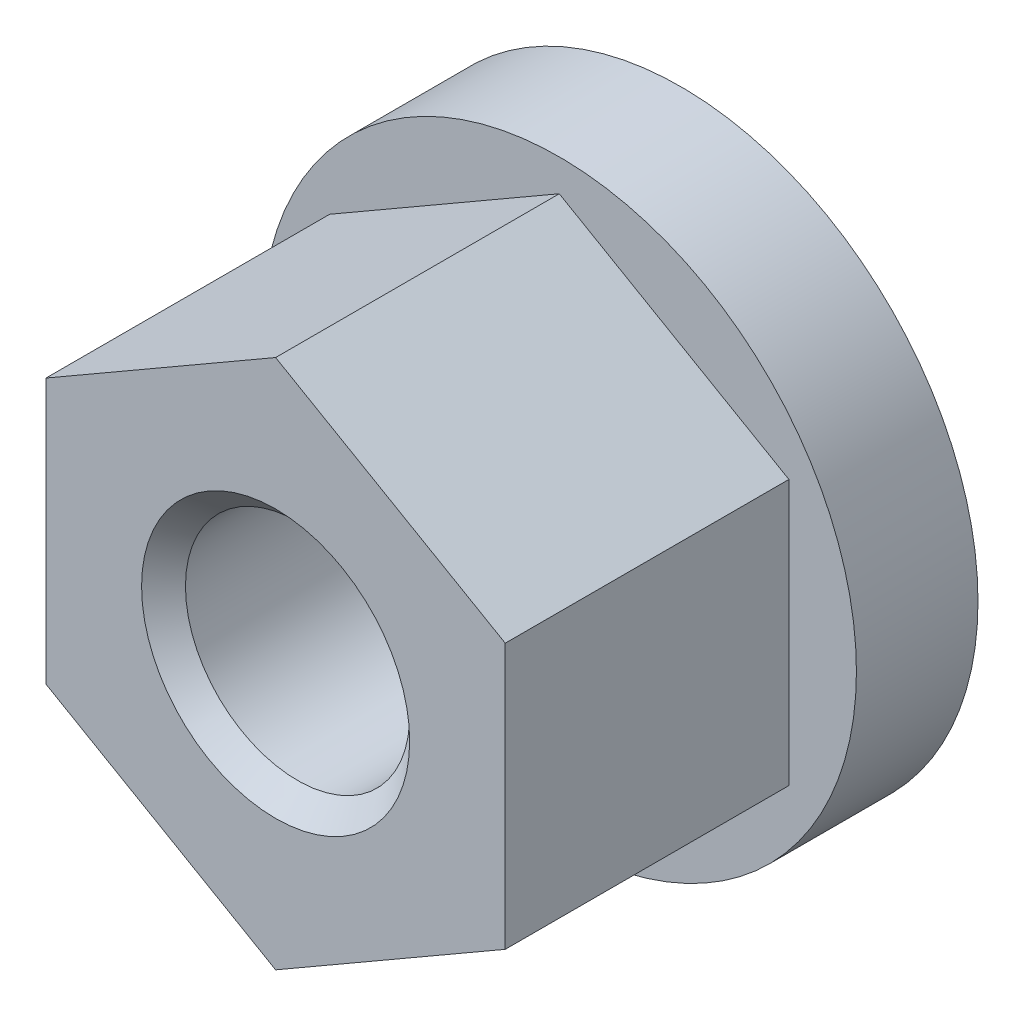
ISO-10303-21;
HEADER;
FILE_DESCRIPTION(('STEP AP214'),'2;1');
FILE_NAME('part.step','',(''),(''),'','','');
FILE_SCHEMA(('AUTOMOTIVE_DESIGN { 1 0 10303 214 1 1 1 1 }'));
ENDSEC;
DATA;
#1=APPLICATION_CONTEXT('core data for automotive mechanical design processes');
#2=APPLICATION_PROTOCOL_DEFINITION('international standard','automotive_design',2000,#1);
#3=PRODUCT_CONTEXT('',#1,'mechanical');
#4=PRODUCT('Part','Part','',(#3));
#5=PRODUCT_RELATED_PRODUCT_CATEGORY('part','',(#4));
#6=PRODUCT_DEFINITION_FORMATION('','',#4);
#7=PRODUCT_DEFINITION_CONTEXT('part definition',#1,'design');
#8=PRODUCT_DEFINITION('design','',#6,#7);
#9=PRODUCT_DEFINITION_SHAPE('','',#8);
#10=(LENGTH_UNIT() NAMED_UNIT(*) SI_UNIT(.MILLI.,.METRE.));
#11=(NAMED_UNIT(*) PLANE_ANGLE_UNIT() SI_UNIT($,.RADIAN.));
#12=(NAMED_UNIT(*) SI_UNIT($,.STERADIAN.) SOLID_ANGLE_UNIT());
#13=UNCERTAINTY_MEASURE_WITH_UNIT(LENGTH_MEASURE(1.E-05),#10,'distance_accuracy_value','');
#14=(GEOMETRIC_REPRESENTATION_CONTEXT(3) GLOBAL_UNCERTAINTY_ASSIGNED_CONTEXT((#13)) GLOBAL_UNIT_ASSIGNED_CONTEXT((#10,
#11,#12)) REPRESENTATION_CONTEXT('',''));
#15=CARTESIAN_POINT('',(0.,0.,0.));
#16=DIRECTION('',(0.,0.,1.));
#17=DIRECTION('',(1.,0.,0.));
#18=AXIS2_PLACEMENT_3D('',#15,#16,#17);
#19=CARTESIAN_POINT('',(0.,0.,-15.));
#20=DIRECTION('',(0.,0.,1.));
#21=DIRECTION('',(1.,0.,0.));
#22=AXIS2_PLACEMENT_3D('',#19,#20,#21);
#23=CYLINDRICAL_SURFACE('',#22,11.);
#24=CARTESIAN_POINT('',(0.,0.,-15.));
#25=DIRECTION('',(0.,0.,1.));
#26=DIRECTION('',(1.,0.,0.));
#27=AXIS2_PLACEMENT_3D('',#24,#25,#26);
#28=CIRCLE('',#27,11.);
#29=CARTESIAN_POINT('',(11.,0.,-15.));
#30=VERTEX_POINT('',#29);
#31=EDGE_CURVE('E112',#30,#30,#28,.T.);
#32=ORIENTED_EDGE('',*,*,#31,.T.);
#33=EDGE_LOOP('',(#32));
#34=FACE_BOUND('',#33,.T.);
#35=CARTESIAN_POINT('',(0.,0.,-10.5));
#36=DIRECTION('',(0.,0.,1.));
#37=DIRECTION('',(1.,0.,0.));
#38=AXIS2_PLACEMENT_3D('',#35,#36,#37);
#39=CIRCLE('',#38,11.);
#40=CARTESIAN_POINT('',(11.,0.,-10.5));
#41=VERTEX_POINT('',#40);
#42=EDGE_CURVE('E109',#41,#41,#39,.T.);
#43=ORIENTED_EDGE('',*,*,#42,.F.);
#44=EDGE_LOOP('',(#43));
#45=FACE_BOUND('',#44,.T.);
#46=ADVANCED_FACE('F35',(#34,#45),#23,.T.);
#47=CARTESIAN_POINT('',(11.,0.,-15.));
#48=DIRECTION('',(0.,0.,-1.));
#49=DIRECTION('',(-1.,0.,0.));
#50=AXIS2_PLACEMENT_3D('',#47,#48,#49);
#51=PLANE('',#50);
#52=CARTESIAN_POINT('',(0.,0.,-15.));
#53=DIRECTION('',(0.,0.,-1.));
#54=DIRECTION('',(-1.,0.,0.));
#55=AXIS2_PLACEMENT_3D('',#52,#53,#54);
#56=CIRCLE('',#55,4.9620000000014);
#57=CARTESIAN_POINT('',(-4.9620000000014,0.,-15.));
#58=VERTEX_POINT('',#57);
#59=EDGE_CURVE('E120',#58,#58,#56,.F.);
#60=ORIENTED_EDGE('',*,*,#59,.T.);
#61=EDGE_LOOP('',(#60));
#62=FACE_BOUND('',#61,.T.);
#63=ORIENTED_EDGE('',*,*,#31,.F.);
#64=EDGE_LOOP('',(#63));
#65=FACE_BOUND('',#64,.T.);
#66=ADVANCED_FACE('F136',(#62,#65),#51,.T.);
#67=CARTESIAN_POINT('',(0.,0.,-10.5));
#68=DIRECTION('',(0.,0.,1.));
#69=DIRECTION('',(1.,0.,0.));
#70=AXIS2_PLACEMENT_3D('',#67,#68,#69);
#71=PLANE('',#70);
#72=DIRECTION('',(0.866025403784439,-0.499999999999999,0.));
#73=VECTOR('',#72,1.);
#74=CARTESIAN_POINT('',(0.,-9.8149545762236,-10.5));
#75=LINE('',#74,#73);
#76=CARTESIAN_POINT('',(-8.5,-4.9074772881118,-10.5));
#77=VERTEX_POINT('',#76);
#78=CARTESIAN_POINT('',(0.,-9.8149545762236,-10.5));
#79=VERTEX_POINT('',#78);
#80=EDGE_CURVE('E51',#77,#79,#75,.T.);
#81=ORIENTED_EDGE('',*,*,#80,.F.);
#82=DIRECTION('',(0.,-1.,0.));
#83=VECTOR('',#82,1.);
#84=CARTESIAN_POINT('',(-8.5,-4.9074772881118,-10.5));
#85=LINE('',#84,#83);
#86=CARTESIAN_POINT('',(-8.5,4.9074772881118,-10.5));
#87=VERTEX_POINT('',#86);
#88=EDGE_CURVE('E55',#87,#77,#85,.T.);
#89=ORIENTED_EDGE('',*,*,#88,.F.);
#90=DIRECTION('',(-0.866025403784439,-0.499999999999999,0.));
#91=VECTOR('',#90,1.);
#92=CARTESIAN_POINT('',(-8.5,4.9074772881118,-10.5));
#93=LINE('',#92,#91);
#94=CARTESIAN_POINT('',(0.,9.8149545762236,-10.5));
#95=VERTEX_POINT('',#94);
#96=EDGE_CURVE('E267',#95,#87,#93,.T.);
#97=ORIENTED_EDGE('',*,*,#96,.F.);
#98=DIRECTION('',(-0.866025403784439,0.499999999999999,0.));
#99=VECTOR('',#98,1.);
#100=CARTESIAN_POINT('',(0.,9.8149545762236,-10.5));
#101=LINE('',#100,#99);
#102=CARTESIAN_POINT('',(8.5,4.9074772881118,-10.5));
#103=VERTEX_POINT('',#102);
#104=EDGE_CURVE('E282',#103,#95,#101,.T.);
#105=ORIENTED_EDGE('',*,*,#104,.F.);
#106=DIRECTION('',(0.,1.,0.));
#107=VECTOR('',#106,1.);
#108=CARTESIAN_POINT('',(8.5,4.9074772881118,-10.5));
#109=LINE('',#108,#107);
#110=CARTESIAN_POINT('',(8.5,-4.9074772881118,-10.5));
#111=VERTEX_POINT('',#110);
#112=EDGE_CURVE('E285',#111,#103,#109,.T.);
#113=ORIENTED_EDGE('',*,*,#112,.F.);
#114=DIRECTION('',(0.866025403784439,0.499999999999999,0.));
#115=VECTOR('',#114,1.);
#116=CARTESIAN_POINT('',(8.5,-4.9074772881118,-10.5));
#117=LINE('',#116,#115);
#118=EDGE_CURVE('E286',#79,#111,#117,.T.);
#119=ORIENTED_EDGE('',*,*,#118,.F.);
#120=EDGE_LOOP('',(#81,#89,#97,#105,#113,#119));
#121=FACE_BOUND('',#120,.T.);
#122=ORIENTED_EDGE('',*,*,#42,.T.);
#123=EDGE_LOOP('',(#122));
#124=FACE_BOUND('',#123,.T.);
#125=ADVANCED_FACE('F139',(#121,#124),#71,.T.);
#126=CARTESIAN_POINT('',(0.,-9.8149545762236,0.));
#127=DIRECTION('',(0.499999999999999,0.866025403784439,0.));
#128=DIRECTION('',(-0.86602540378444,0.499999999999999,0.));
#129=AXIS2_PLACEMENT_3D('',#126,#127,#128);
#130=PLANE('',#129);
#131=ORIENTED_EDGE('',*,*,#80,.T.);
#132=DIRECTION('',(0.,0.,-1.));
#133=VECTOR('',#132,1.);
#134=CARTESIAN_POINT('',(0.,-9.8149545762236,0.));
#135=LINE('',#134,#133);
#136=CARTESIAN_POINT('',(0.,-9.8149545762236,0.));
#137=VERTEX_POINT('',#136);
#138=EDGE_CURVE('E92',#137,#79,#135,.T.);
#139=ORIENTED_EDGE('',*,*,#138,.F.);
#140=DIRECTION('',(0.866025403784439,-0.499999999999999,0.));
#141=VECTOR('',#140,1.);
#142=CARTESIAN_POINT('',(0.,-9.8149545762236,0.));
#143=LINE('',#142,#141);
#144=CARTESIAN_POINT('',(-8.5,-4.9074772881118,0.));
#145=VERTEX_POINT('',#144);
#146=EDGE_CURVE('E98',#145,#137,#143,.T.);
#147=ORIENTED_EDGE('',*,*,#146,.F.);
#148=DIRECTION('',(0.,0.,-1.));
#149=VECTOR('',#148,1.);
#150=CARTESIAN_POINT('',(-8.5,-4.9074772881118,0.));
#151=LINE('',#150,#149);
#152=EDGE_CURVE('E264',#145,#77,#151,.T.);
#153=ORIENTED_EDGE('',*,*,#152,.T.);
#154=EDGE_LOOP('',(#131,#139,#147,#153));
#155=FACE_BOUND('',#154,.T.);
#156=ADVANCED_FACE('F108',(#155),#130,.F.);
#157=CARTESIAN_POINT('',(8.5,-4.9074772881118,0.));
#158=DIRECTION('',(-0.499999999999999,0.866025403784439,0.));
#159=DIRECTION('',(-0.86602540378444,-0.499999999999999,0.));
#160=AXIS2_PLACEMENT_3D('',#157,#158,#159);
#161=PLANE('',#160);
#162=ORIENTED_EDGE('',*,*,#118,.T.);
#163=DIRECTION('',(0.,0.,-1.));
#164=VECTOR('',#163,1.);
#165=CARTESIAN_POINT('',(8.5,-4.9074772881118,0.));
#166=LINE('',#165,#164);
#167=CARTESIAN_POINT('',(8.5,-4.9074772881118,0.));
#168=VERTEX_POINT('',#167);
#169=EDGE_CURVE('E94',#168,#111,#166,.T.);
#170=ORIENTED_EDGE('',*,*,#169,.F.);
#171=DIRECTION('',(0.866025403784439,0.499999999999999,0.));
#172=VECTOR('',#171,1.);
#173=CARTESIAN_POINT('',(8.5,-4.9074772881118,0.));
#174=LINE('',#173,#172);
#175=EDGE_CURVE('E87',#137,#168,#174,.T.);
#176=ORIENTED_EDGE('',*,*,#175,.F.);
#177=ORIENTED_EDGE('',*,*,#138,.T.);
#178=EDGE_LOOP('',(#162,#170,#176,#177));
#179=FACE_BOUND('',#178,.T.);
#180=ADVANCED_FACE('F90',(#179),#161,.F.);
#181=CARTESIAN_POINT('',(8.5,4.9074772881118,0.));
#182=DIRECTION('',(-1.,0.,0.));
#183=DIRECTION('',(0.,0.,1.));
#184=AXIS2_PLACEMENT_3D('',#181,#182,#183);
#185=PLANE('',#184);
#186=ORIENTED_EDGE('',*,*,#112,.T.);
#187=DIRECTION('',(0.,0.,-1.));
#188=VECTOR('',#187,1.);
#189=CARTESIAN_POINT('',(8.5,4.9074772881118,0.));
#190=LINE('',#189,#188);
#191=CARTESIAN_POINT('',(8.5,4.9074772881118,0.));
#192=VERTEX_POINT('',#191);
#193=EDGE_CURVE('E114',#192,#103,#190,.T.);
#194=ORIENTED_EDGE('',*,*,#193,.F.);
#195=DIRECTION('',(0.,1.,0.));
#196=VECTOR('',#195,1.);
#197=CARTESIAN_POINT('',(8.5,4.9074772881118,0.));
#198=LINE('',#197,#196);
#199=EDGE_CURVE('E97',#168,#192,#198,.T.);
#200=ORIENTED_EDGE('',*,*,#199,.F.);
#201=ORIENTED_EDGE('',*,*,#169,.T.);
#202=EDGE_LOOP('',(#186,#194,#200,#201));
#203=FACE_BOUND('',#202,.T.);
#204=ADVANCED_FACE('F162',(#203),#185,.F.);
#205=CARTESIAN_POINT('',(0.,9.8149545762236,0.));
#206=DIRECTION('',(-0.499999999999999,-0.866025403784439,0.));
#207=DIRECTION('',(0.86602540378444,-0.499999999999999,0.));
#208=AXIS2_PLACEMENT_3D('',#205,#206,#207);
#209=PLANE('',#208);
#210=ORIENTED_EDGE('',*,*,#104,.T.);
#211=DIRECTION('',(0.,0.,-1.));
#212=VECTOR('',#211,1.);
#213=CARTESIAN_POINT('',(0.,9.8149545762236,0.));
#214=LINE('',#213,#212);
#215=CARTESIAN_POINT('',(0.,9.8149545762236,0.));
#216=VERTEX_POINT('',#215);
#217=EDGE_CURVE('E270',#216,#95,#214,.T.);
#218=ORIENTED_EDGE('',*,*,#217,.F.);
#219=DIRECTION('',(-0.866025403784439,0.499999999999999,0.));
#220=VECTOR('',#219,1.);
#221=CARTESIAN_POINT('',(0.,9.8149545762236,0.));
#222=LINE('',#221,#220);
#223=EDGE_CURVE('E283',#192,#216,#222,.T.);
#224=ORIENTED_EDGE('',*,*,#223,.F.);
#225=ORIENTED_EDGE('',*,*,#193,.T.);
#226=EDGE_LOOP('',(#210,#218,#224,#225));
#227=FACE_BOUND('',#226,.T.);
#228=ADVANCED_FACE('F165',(#227),#209,.F.);
#229=CARTESIAN_POINT('',(-8.5,4.9074772881118,0.));
#230=DIRECTION('',(0.499999999999999,-0.866025403784439,0.));
#231=DIRECTION('',(0.86602540378444,0.499999999999999,0.));
#232=AXIS2_PLACEMENT_3D('',#229,#230,#231);
#233=PLANE('',#232);
#234=ORIENTED_EDGE('',*,*,#96,.T.);
#235=DIRECTION('',(0.,0.,-1.));
#236=VECTOR('',#235,1.);
#237=CARTESIAN_POINT('',(-8.5,4.9074772881118,0.));
#238=LINE('',#237,#236);
#239=CARTESIAN_POINT('',(-8.5,4.9074772881118,0.));
#240=VERTEX_POINT('',#239);
#241=EDGE_CURVE('E266',#240,#87,#238,.T.);
#242=ORIENTED_EDGE('',*,*,#241,.F.);
#243=DIRECTION('',(-0.866025403784439,-0.499999999999999,0.));
#244=VECTOR('',#243,1.);
#245=CARTESIAN_POINT('',(-8.5,4.9074772881118,0.));
#246=LINE('',#245,#244);
#247=EDGE_CURVE('E272',#216,#240,#246,.T.);
#248=ORIENTED_EDGE('',*,*,#247,.F.);
#249=ORIENTED_EDGE('',*,*,#217,.T.);
#250=EDGE_LOOP('',(#234,#242,#248,#249));
#251=FACE_BOUND('',#250,.T.);
#252=ADVANCED_FACE('F169',(#251),#233,.F.);
#253=CARTESIAN_POINT('',(-8.5,-4.9074772881118,0.));
#254=DIRECTION('',(1.,0.,0.));
#255=DIRECTION('',(0.,0.,-1.));
#256=AXIS2_PLACEMENT_3D('',#253,#254,#255);
#257=PLANE('',#256);
#258=ORIENTED_EDGE('',*,*,#88,.T.);
#259=ORIENTED_EDGE('',*,*,#152,.F.);
#260=DIRECTION('',(0.,-1.,0.));
#261=VECTOR('',#260,1.);
#262=CARTESIAN_POINT('',(-8.5,-4.9074772881118,0.));
#263=LINE('',#262,#261);
#264=EDGE_CURVE('E103',#240,#145,#263,.T.);
#265=ORIENTED_EDGE('',*,*,#264,.F.);
#266=ORIENTED_EDGE('',*,*,#241,.T.);
#267=EDGE_LOOP('',(#258,#259,#265,#266));
#268=FACE_BOUND('',#267,.T.);
#269=ADVANCED_FACE('F173',(#268),#257,.F.);
#270=CARTESIAN_POINT('',(0.,0.,0.));
#271=DIRECTION('',(0.,0.,-1.));
#272=DIRECTION('',(-1.,0.,0.));
#273=AXIS2_PLACEMENT_3D('',#270,#271,#272);
#274=PLANE('',#273);
#275=CARTESIAN_POINT('',(0.,0.,0.));
#276=DIRECTION('',(0.,0.,-1.));
#277=DIRECTION('',(-1.,0.,0.));
#278=AXIS2_PLACEMENT_3D('',#275,#276,#277);
#279=CIRCLE('',#278,4.9620000000014);
#280=CARTESIAN_POINT('',(-4.9620000000014,0.,0.));
#281=VERTEX_POINT('',#280);
#282=EDGE_CURVE('E11',#281,#281,#279,.T.);
#283=ORIENTED_EDGE('',*,*,#282,.T.);
#284=EDGE_LOOP('',(#283));
#285=FACE_BOUND('',#284,.T.);
#286=ORIENTED_EDGE('',*,*,#146,.T.);
#287=ORIENTED_EDGE('',*,*,#175,.T.);
#288=ORIENTED_EDGE('',*,*,#199,.T.);
#289=ORIENTED_EDGE('',*,*,#223,.T.);
#290=ORIENTED_EDGE('',*,*,#247,.T.);
#291=ORIENTED_EDGE('',*,*,#264,.T.);
#292=EDGE_LOOP('',(#286,#287,#288,#289,#290,#291));
#293=FACE_BOUND('',#292,.T.);
#294=ADVANCED_FACE('F101',(#285,#293),#274,.F.);
#295=CARTESIAN_POINT('',(0.,0.,0.));
#296=DIRECTION('',(0.,0.,1.));
#297=DIRECTION('',(1.,0.,0.));
#298=AXIS2_PLACEMENT_3D('',#295,#296,#297);
#299=CYLINDRICAL_SURFACE('',#298,4.15000000000001);
#300=CARTESIAN_POINT('',(0.,0.,-14.1879999999986));
#301=DIRECTION('',(0.,0.,-1.));
#302=DIRECTION('',(-1.,0.,0.));
#303=AXIS2_PLACEMENT_3D('',#300,#301,#302);
#304=CIRCLE('',#303,4.15000000000001);
#305=CARTESIAN_POINT('',(-4.15000000000001,0.,-14.1879999999986));
#306=VERTEX_POINT('',#305);
#307=EDGE_CURVE('E44',#306,#306,#304,.T.);
#308=ORIENTED_EDGE('',*,*,#307,.T.);
#309=EDGE_LOOP('',(#308));
#310=FACE_BOUND('',#309,.T.);
#311=CARTESIAN_POINT('',(0.,0.,-0.812000000001388));
#312=DIRECTION('',(0.,0.,-1.));
#313=DIRECTION('',(-1.,0.,0.));
#314=AXIS2_PLACEMENT_3D('',#311,#312,#313);
#315=CIRCLE('',#314,4.15000000000001);
#316=CARTESIAN_POINT('',(-4.15000000000001,0.,-0.812000000001388));
#317=VERTEX_POINT('',#316);
#318=EDGE_CURVE('E123',#317,#317,#315,.F.);
#319=ORIENTED_EDGE('',*,*,#318,.T.);
#320=EDGE_LOOP('',(#319));
#321=FACE_BOUND('',#320,.T.);
#322=ADVANCED_FACE('F128',(#310,#321),#299,.F.);
#323=CARTESIAN_POINT('',(0.,0.,-15.));
#324=DIRECTION('',(0.,0.,-1.));
#325=DIRECTION('',(-1.,0.,0.));
#326=AXIS2_PLACEMENT_3D('',#323,#324,#325);
#327=CONICAL_SURFACE('',#326,4.9620000000014,0.785398163397445);
#328=ORIENTED_EDGE('',*,*,#307,.F.);
#329=EDGE_LOOP('',(#328));
#330=FACE_BOUND('',#329,.T.);
#331=ORIENTED_EDGE('',*,*,#59,.F.);
#332=EDGE_LOOP('',(#331));
#333=FACE_BOUND('',#332,.T.);
#334=ADVANCED_FACE('F131',(#330,#333),#327,.F.);
#335=CARTESIAN_POINT('',(0.,0.,-0.812000000001388));
#336=DIRECTION('',(0.,0.,1.));
#337=DIRECTION('',(1.,0.,0.));
#338=AXIS2_PLACEMENT_3D('',#335,#336,#337);
#339=CONICAL_SURFACE('',#338,4.15000000000001,0.78539816339745);
#340=ORIENTED_EDGE('',*,*,#282,.F.);
#341=EDGE_LOOP('',(#340));
#342=FACE_BOUND('',#341,.T.);
#343=ORIENTED_EDGE('',*,*,#318,.F.);
#344=EDGE_LOOP('',(#343));
#345=FACE_BOUND('',#344,.T.);
#346=ADVANCED_FACE('F38',(#342,#345),#339,.F.);
#347=CLOSED_SHELL('',(#46,#66,#125,#156,#180,#204,#228,#252,#269,#294,#322,#334,#346));
#348=MANIFOLD_SOLID_BREP('B2',#347);
#349=ADVANCED_BREP_SHAPE_REPRESENTATION('',(#18,#348),#14);
#350=SHAPE_DEFINITION_REPRESENTATION(#9,#349);
ENDSEC;
END-ISO-10303-21;
